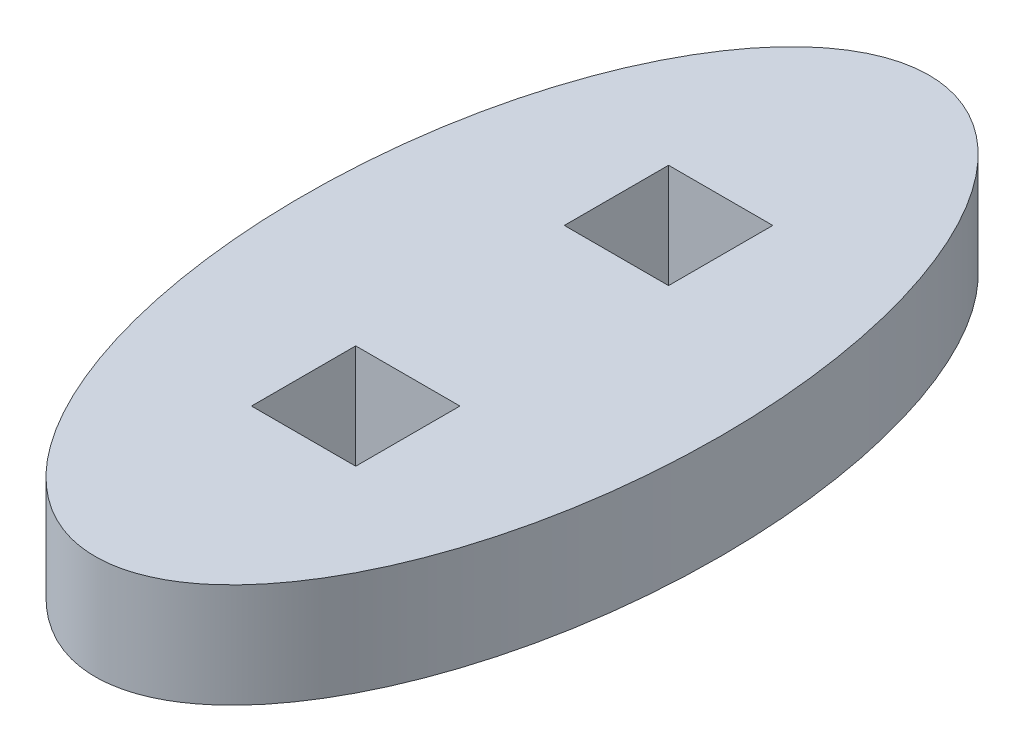
ISO-10303-21;
HEADER;
FILE_DESCRIPTION(('STEP AP214'),'2;1');
FILE_NAME('part.step','',(''),(''),'','','');
FILE_SCHEMA(('AUTOMOTIVE_DESIGN { 1 0 10303 214 1 1 1 1 }'));
ENDSEC;
DATA;
#1=APPLICATION_CONTEXT('core data for automotive mechanical design processes');
#2=APPLICATION_PROTOCOL_DEFINITION('international standard','automotive_design',2000,#1);
#3=PRODUCT_CONTEXT('',#1,'mechanical');
#4=PRODUCT('Part','Part','',(#3));
#5=PRODUCT_RELATED_PRODUCT_CATEGORY('part','',(#4));
#6=PRODUCT_DEFINITION_FORMATION('','',#4);
#7=PRODUCT_DEFINITION_CONTEXT('part definition',#1,'design');
#8=PRODUCT_DEFINITION('design','',#6,#7);
#9=PRODUCT_DEFINITION_SHAPE('','',#8);
#10=(LENGTH_UNIT() NAMED_UNIT(*) SI_UNIT(.MILLI.,.METRE.));
#11=(NAMED_UNIT(*) PLANE_ANGLE_UNIT() SI_UNIT($,.RADIAN.));
#12=(NAMED_UNIT(*) SI_UNIT($,.STERADIAN.) SOLID_ANGLE_UNIT());
#13=UNCERTAINTY_MEASURE_WITH_UNIT(LENGTH_MEASURE(1.E-05),#10,'distance_accuracy_value','');
#14=(GEOMETRIC_REPRESENTATION_CONTEXT(3) GLOBAL_UNCERTAINTY_ASSIGNED_CONTEXT((#13)) GLOBAL_UNIT_ASSIGNED_CONTEXT((#10,
#11,#12)) REPRESENTATION_CONTEXT('',''));
#15=CARTESIAN_POINT('',(0.,0.,0.));
#16=DIRECTION('',(0.,0.,1.));
#17=DIRECTION('',(1.,0.,0.));
#18=AXIS2_PLACEMENT_3D('',#15,#16,#17);
#19=CARTESIAN_POINT('',(0.,3.175,0.));
#20=DIRECTION('',(0.,1.,0.));
#21=DIRECTION('',(0.,0.,-1.));
#22=AXIS2_PLACEMENT_3D('',#19,#20,#21);
#23=ELLIPSE('',#22,12.7,6.35);
#24=DIRECTION('',(0.,-1.,0.));
#25=VECTOR('',#24,1.);
#26=SURFACE_OF_LINEAR_EXTRUSION('',#23,#25);
#27=CARTESIAN_POINT('',(0.,3.175,-12.7));
#28=VERTEX_POINT('',#27);
#29=EDGE_CURVE('E11',#28,#28,#23,.T.);
#30=ORIENTED_EDGE('',*,*,#29,.F.);
#31=EDGE_LOOP('',(#30));
#32=FACE_BOUND('',#31,.T.);
#33=CARTESIAN_POINT('',(0.,0.,0.));
#34=DIRECTION('',(0.,1.,0.));
#35=DIRECTION('',(0.,0.,-1.));
#36=AXIS2_PLACEMENT_3D('',#33,#34,#35);
#37=ELLIPSE('',#36,12.7,6.35);
#38=CARTESIAN_POINT('',(0.,0.,-12.7));
#39=VERTEX_POINT('',#38);
#40=EDGE_CURVE('E36',#39,#39,#37,.T.);
#41=ORIENTED_EDGE('',*,*,#40,.T.);
#42=EDGE_LOOP('',(#41));
#43=FACE_BOUND('',#42,.T.);
#44=ADVANCED_FACE('F32',(#32,#43),#26,.F.);
#45=CARTESIAN_POINT('',(0.,3.175,0.));
#46=DIRECTION('',(0.,1.,0.));
#47=DIRECTION('',(0.,0.,1.));
#48=AXIS2_PLACEMENT_3D('',#45,#46,#47);
#49=PLANE('',#48);
#50=DIRECTION('',(0.,0.,-1.));
#51=VECTOR('',#50,1.);
#52=CARTESIAN_POINT('',(1.5875,3.175,3.175));
#53=LINE('',#52,#51);
#54=CARTESIAN_POINT('',(1.5875,3.175,6.35));
#55=VERTEX_POINT('',#54);
#56=CARTESIAN_POINT('',(1.5875,3.175,3.175));
#57=VERTEX_POINT('',#56);
#58=EDGE_CURVE('E46',#55,#57,#53,.T.);
#59=ORIENTED_EDGE('',*,*,#58,.F.);
#60=DIRECTION('',(1.,0.,0.));
#61=VECTOR('',#60,1.);
#62=CARTESIAN_POINT('',(-1.5875,3.175,6.35));
#63=LINE('',#62,#61);
#64=CARTESIAN_POINT('',(-1.5875,3.175,6.35));
#65=VERTEX_POINT('',#64);
#66=EDGE_CURVE('E117',#65,#55,#63,.T.);
#67=ORIENTED_EDGE('',*,*,#66,.F.);
#68=DIRECTION('',(0.,0.,1.));
#69=VECTOR('',#68,1.);
#70=CARTESIAN_POINT('',(-1.5875,3.175,3.175));
#71=LINE('',#70,#69);
#72=CARTESIAN_POINT('',(-1.5875,3.175,3.175));
#73=VERTEX_POINT('',#72);
#74=EDGE_CURVE('E120',#73,#65,#71,.T.);
#75=ORIENTED_EDGE('',*,*,#74,.F.);
#76=DIRECTION('',(-1.,0.,0.));
#77=VECTOR('',#76,1.);
#78=CARTESIAN_POINT('',(-1.5875,3.175,3.175));
#79=LINE('',#78,#77);
#80=EDGE_CURVE('E126',#57,#73,#79,.T.);
#81=ORIENTED_EDGE('',*,*,#80,.F.);
#82=EDGE_LOOP('',(#59,#67,#75,#81));
#83=FACE_BOUND('',#82,.T.);
#84=DIRECTION('',(1.,0.,0.));
#85=VECTOR('',#84,1.);
#86=CARTESIAN_POINT('',(-1.58750000000003,3.175,-3.18));
#87=LINE('',#86,#85);
#88=CARTESIAN_POINT('',(-1.58750000000003,3.175,-3.18));
#89=VERTEX_POINT('',#88);
#90=CARTESIAN_POINT('',(1.58749999999997,3.175,-3.18));
#91=VERTEX_POINT('',#90);
#92=EDGE_CURVE('E54',#89,#91,#87,.T.);
#93=ORIENTED_EDGE('',*,*,#92,.F.);
#94=DIRECTION('',(0.,0.,1.));
#95=VECTOR('',#94,1.);
#96=CARTESIAN_POINT('',(-1.58750000000003,3.175,-6.355));
#97=LINE('',#96,#95);
#98=CARTESIAN_POINT('',(-1.58750000000003,3.175,-6.355));
#99=VERTEX_POINT('',#98);
#100=EDGE_CURVE('E140',#99,#89,#97,.T.);
#101=ORIENTED_EDGE('',*,*,#100,.F.);
#102=DIRECTION('',(-1.,0.,0.));
#103=VECTOR('',#102,1.);
#104=CARTESIAN_POINT('',(-1.58750000000003,3.175,-6.355));
#105=LINE('',#104,#103);
#106=CARTESIAN_POINT('',(1.58749999999997,3.175,-6.355));
#107=VERTEX_POINT('',#106);
#108=EDGE_CURVE('E154',#107,#99,#105,.T.);
#109=ORIENTED_EDGE('',*,*,#108,.F.);
#110=DIRECTION('',(0.,0.,-1.));
#111=VECTOR('',#110,1.);
#112=CARTESIAN_POINT('',(1.58749999999997,3.175,-6.355));
#113=LINE('',#112,#111);
#114=EDGE_CURVE('E151',#91,#107,#113,.T.);
#115=ORIENTED_EDGE('',*,*,#114,.F.);
#116=EDGE_LOOP('',(#93,#101,#109,#115));
#117=FACE_BOUND('',#116,.T.);
#118=ORIENTED_EDGE('',*,*,#29,.T.);
#119=EDGE_LOOP('',(#118));
#120=FACE_BOUND('',#119,.T.);
#121=ADVANCED_FACE('F173',(#83,#117,#120),#49,.T.);
#122=CARTESIAN_POINT('',(0.,0.,0.));
#123=DIRECTION('',(0.,1.,0.));
#124=DIRECTION('',(0.,0.,1.));
#125=AXIS2_PLACEMENT_3D('',#122,#123,#124);
#126=PLANE('',#125);
#127=DIRECTION('',(1.,0.,0.));
#128=VECTOR('',#127,1.);
#129=CARTESIAN_POINT('',(-1.5875,0.,6.35));
#130=LINE('',#129,#128);
#131=CARTESIAN_POINT('',(-1.5875,0.,6.35));
#132=VERTEX_POINT('',#131);
#133=CARTESIAN_POINT('',(1.5875,0.,6.35));
#134=VERTEX_POINT('',#133);
#135=EDGE_CURVE('E104',#132,#134,#130,.T.);
#136=ORIENTED_EDGE('',*,*,#135,.T.);
#137=DIRECTION('',(0.,0.,-1.));
#138=VECTOR('',#137,1.);
#139=CARTESIAN_POINT('',(1.5875,0.,3.175));
#140=LINE('',#139,#138);
#141=CARTESIAN_POINT('',(1.5875,0.,3.175));
#142=VERTEX_POINT('',#141);
#143=EDGE_CURVE('E98',#134,#142,#140,.T.);
#144=ORIENTED_EDGE('',*,*,#143,.T.);
#145=DIRECTION('',(-1.,0.,0.));
#146=VECTOR('',#145,1.);
#147=CARTESIAN_POINT('',(-1.5875,0.,3.175));
#148=LINE('',#147,#146);
#149=CARTESIAN_POINT('',(-1.5875,0.,3.175));
#150=VERTEX_POINT('',#149);
#151=EDGE_CURVE('E108',#142,#150,#148,.T.);
#152=ORIENTED_EDGE('',*,*,#151,.T.);
#153=DIRECTION('',(0.,0.,1.));
#154=VECTOR('',#153,1.);
#155=CARTESIAN_POINT('',(-1.5875,0.,3.175));
#156=LINE('',#155,#154);
#157=EDGE_CURVE('E112',#150,#132,#156,.T.);
#158=ORIENTED_EDGE('',*,*,#157,.T.);
#159=EDGE_LOOP('',(#136,#144,#152,#158));
#160=FACE_BOUND('',#159,.T.);
#161=DIRECTION('',(0.,0.,1.));
#162=VECTOR('',#161,1.);
#163=CARTESIAN_POINT('',(-1.58750000000003,0.,-6.355));
#164=LINE('',#163,#162);
#165=CARTESIAN_POINT('',(-1.58750000000003,0.,-6.355));
#166=VERTEX_POINT('',#165);
#167=CARTESIAN_POINT('',(-1.58750000000003,0.,-3.18));
#168=VERTEX_POINT('',#167);
#169=EDGE_CURVE('E146',#166,#168,#164,.T.);
#170=ORIENTED_EDGE('',*,*,#169,.T.);
#171=DIRECTION('',(1.,0.,0.));
#172=VECTOR('',#171,1.);
#173=CARTESIAN_POINT('',(-1.58750000000003,0.,-3.18));
#174=LINE('',#173,#172);
#175=CARTESIAN_POINT('',(1.58749999999997,0.,-3.18));
#176=VERTEX_POINT('',#175);
#177=EDGE_CURVE('E136',#168,#176,#174,.T.);
#178=ORIENTED_EDGE('',*,*,#177,.T.);
#179=DIRECTION('',(0.,0.,-1.));
#180=VECTOR('',#179,1.);
#181=CARTESIAN_POINT('',(1.58749999999997,0.,-6.355));
#182=LINE('',#181,#180);
#183=CARTESIAN_POINT('',(1.58749999999997,0.,-6.355));
#184=VERTEX_POINT('',#183);
#185=EDGE_CURVE('E139',#176,#184,#182,.T.);
#186=ORIENTED_EDGE('',*,*,#185,.T.);
#187=DIRECTION('',(-1.,0.,0.));
#188=VECTOR('',#187,1.);
#189=CARTESIAN_POINT('',(-1.58750000000003,0.,-6.355));
#190=LINE('',#189,#188);
#191=EDGE_CURVE('E143',#184,#166,#190,.T.);
#192=ORIENTED_EDGE('',*,*,#191,.T.);
#193=EDGE_LOOP('',(#170,#178,#186,#192));
#194=FACE_BOUND('',#193,.T.);
#195=ORIENTED_EDGE('',*,*,#40,.F.);
#196=EDGE_LOOP('',(#195));
#197=FACE_BOUND('',#196,.T.);
#198=ADVANCED_FACE('F114',(#160,#194,#197),#126,.F.);
#199=CARTESIAN_POINT('',(-1.58750000000003,0.,-3.18));
#200=DIRECTION('',(0.,0.,1.));
#201=DIRECTION('',(1.,0.,0.));
#202=AXIS2_PLACEMENT_3D('',#199,#200,#201);
#203=PLANE('',#202);
#204=ORIENTED_EDGE('',*,*,#92,.T.);
#205=DIRECTION('',(0.,1.,0.));
#206=VECTOR('',#205,1.);
#207=CARTESIAN_POINT('',(1.58749999999997,0.,-3.18));
#208=LINE('',#207,#206);
#209=EDGE_CURVE('E149',#176,#91,#208,.T.);
#210=ORIENTED_EDGE('',*,*,#209,.F.);
#211=ORIENTED_EDGE('',*,*,#177,.F.);
#212=DIRECTION('',(0.,1.,0.));
#213=VECTOR('',#212,1.);
#214=CARTESIAN_POINT('',(-1.58750000000003,0.,-3.18));
#215=LINE('',#214,#213);
#216=EDGE_CURVE('E127',#168,#89,#215,.T.);
#217=ORIENTED_EDGE('',*,*,#216,.T.);
#218=EDGE_LOOP('',(#204,#210,#211,#217));
#219=FACE_BOUND('',#218,.T.);
#220=ADVANCED_FACE('F180',(#219),#203,.F.);
#221=CARTESIAN_POINT('',(-1.58750000000003,0.,-6.355));
#222=DIRECTION('',(-1.,0.,0.));
#223=DIRECTION('',(0.,0.,1.));
#224=AXIS2_PLACEMENT_3D('',#221,#222,#223);
#225=PLANE('',#224);
#226=ORIENTED_EDGE('',*,*,#100,.T.);
#227=ORIENTED_EDGE('',*,*,#216,.F.);
#228=ORIENTED_EDGE('',*,*,#169,.F.);
#229=DIRECTION('',(0.,1.,0.));
#230=VECTOR('',#229,1.);
#231=CARTESIAN_POINT('',(-1.58750000000003,0.,-6.355));
#232=LINE('',#231,#230);
#233=EDGE_CURVE('E160',#166,#99,#232,.T.);
#234=ORIENTED_EDGE('',*,*,#233,.T.);
#235=EDGE_LOOP('',(#226,#227,#228,#234));
#236=FACE_BOUND('',#235,.T.);
#237=ADVANCED_FACE('F182',(#236),#225,.F.);
#238=CARTESIAN_POINT('',(-1.58750000000003,0.,-6.355));
#239=DIRECTION('',(0.,0.,-1.));
#240=DIRECTION('',(-1.,0.,0.));
#241=AXIS2_PLACEMENT_3D('',#238,#239,#240);
#242=PLANE('',#241);
#243=ORIENTED_EDGE('',*,*,#108,.T.);
#244=ORIENTED_EDGE('',*,*,#233,.F.);
#245=ORIENTED_EDGE('',*,*,#191,.F.);
#246=DIRECTION('',(0.,1.,0.));
#247=VECTOR('',#246,1.);
#248=CARTESIAN_POINT('',(1.58749999999997,0.,-6.355));
#249=LINE('',#248,#247);
#250=EDGE_CURVE('E162',#184,#107,#249,.T.);
#251=ORIENTED_EDGE('',*,*,#250,.T.);
#252=EDGE_LOOP('',(#243,#244,#245,#251));
#253=FACE_BOUND('',#252,.T.);
#254=ADVANCED_FACE('F177',(#253),#242,.F.);
#255=CARTESIAN_POINT('',(1.58749999999997,0.,-6.355));
#256=DIRECTION('',(1.,0.,0.));
#257=DIRECTION('',(0.,0.,-1.));
#258=AXIS2_PLACEMENT_3D('',#255,#256,#257);
#259=PLANE('',#258);
#260=ORIENTED_EDGE('',*,*,#114,.T.);
#261=ORIENTED_EDGE('',*,*,#250,.F.);
#262=ORIENTED_EDGE('',*,*,#185,.F.);
#263=ORIENTED_EDGE('',*,*,#209,.T.);
#264=EDGE_LOOP('',(#260,#261,#262,#263));
#265=FACE_BOUND('',#264,.T.);
#266=ADVANCED_FACE('F168',(#265),#259,.F.);
#267=CARTESIAN_POINT('',(1.5875,0.,3.175));
#268=DIRECTION('',(1.,0.,0.));
#269=DIRECTION('',(0.,0.,-1.));
#270=AXIS2_PLACEMENT_3D('',#267,#268,#269);
#271=PLANE('',#270);
#272=ORIENTED_EDGE('',*,*,#58,.T.);
#273=DIRECTION('',(0.,1.,0.));
#274=VECTOR('',#273,1.);
#275=CARTESIAN_POINT('',(1.5875,0.,3.175));
#276=LINE('',#275,#274);
#277=EDGE_CURVE('E94',#142,#57,#276,.T.);
#278=ORIENTED_EDGE('',*,*,#277,.F.);
#279=ORIENTED_EDGE('',*,*,#143,.F.);
#280=DIRECTION('',(0.,1.,0.));
#281=VECTOR('',#280,1.);
#282=CARTESIAN_POINT('',(1.5875,0.,6.35));
#283=LINE('',#282,#281);
#284=EDGE_CURVE('E131',#134,#55,#283,.T.);
#285=ORIENTED_EDGE('',*,*,#284,.T.);
#286=EDGE_LOOP('',(#272,#278,#279,#285));
#287=FACE_BOUND('',#286,.T.);
#288=ADVANCED_FACE('F96',(#287),#271,.F.);
#289=CARTESIAN_POINT('',(-1.5875,0.,6.35));
#290=DIRECTION('',(0.,0.,1.));
#291=DIRECTION('',(1.,0.,0.));
#292=AXIS2_PLACEMENT_3D('',#289,#290,#291);
#293=PLANE('',#292);
#294=ORIENTED_EDGE('',*,*,#66,.T.);
#295=ORIENTED_EDGE('',*,*,#284,.F.);
#296=ORIENTED_EDGE('',*,*,#135,.F.);
#297=DIRECTION('',(0.,1.,0.));
#298=VECTOR('',#297,1.);
#299=CARTESIAN_POINT('',(-1.5875,0.,6.35));
#300=LINE('',#299,#298);
#301=EDGE_CURVE('E133',#132,#65,#300,.T.);
#302=ORIENTED_EDGE('',*,*,#301,.T.);
#303=EDGE_LOOP('',(#294,#295,#296,#302));
#304=FACE_BOUND('',#303,.T.);
#305=ADVANCED_FACE('F211',(#304),#293,.F.);
#306=CARTESIAN_POINT('',(-1.5875,0.,3.175));
#307=DIRECTION('',(-1.,0.,0.));
#308=DIRECTION('',(0.,0.,1.));
#309=AXIS2_PLACEMENT_3D('',#306,#307,#308);
#310=PLANE('',#309);
#311=ORIENTED_EDGE('',*,*,#74,.T.);
#312=ORIENTED_EDGE('',*,*,#301,.F.);
#313=ORIENTED_EDGE('',*,*,#157,.F.);
#314=DIRECTION('',(0.,1.,0.));
#315=VECTOR('',#314,1.);
#316=CARTESIAN_POINT('',(-1.5875,0.,3.175));
#317=LINE('',#316,#315);
#318=EDGE_CURVE('E103',#150,#73,#317,.T.);
#319=ORIENTED_EDGE('',*,*,#318,.T.);
#320=EDGE_LOOP('',(#311,#312,#313,#319));
#321=FACE_BOUND('',#320,.T.);
#322=ADVANCED_FACE('F215',(#321),#310,.F.);
#323=CARTESIAN_POINT('',(-1.5875,0.,3.175));
#324=DIRECTION('',(0.,0.,-1.));
#325=DIRECTION('',(-1.,0.,0.));
#326=AXIS2_PLACEMENT_3D('',#323,#324,#325);
#327=PLANE('',#326);
#328=ORIENTED_EDGE('',*,*,#80,.T.);
#329=ORIENTED_EDGE('',*,*,#318,.F.);
#330=ORIENTED_EDGE('',*,*,#151,.F.);
#331=ORIENTED_EDGE('',*,*,#277,.T.);
#332=EDGE_LOOP('',(#328,#329,#330,#331));
#333=FACE_BOUND('',#332,.T.);
#334=ADVANCED_FACE('F109',(#333),#327,.F.);
#335=CLOSED_SHELL('',(#44,#121,#198,#220,#237,#254,#266,#288,#305,#322,#334));
#336=MANIFOLD_SOLID_BREP('B2',#335);
#337=ADVANCED_BREP_SHAPE_REPRESENTATION('',(#18,#336),#14);
#338=SHAPE_DEFINITION_REPRESENTATION(#9,#337);
ENDSEC;
END-ISO-10303-21;
